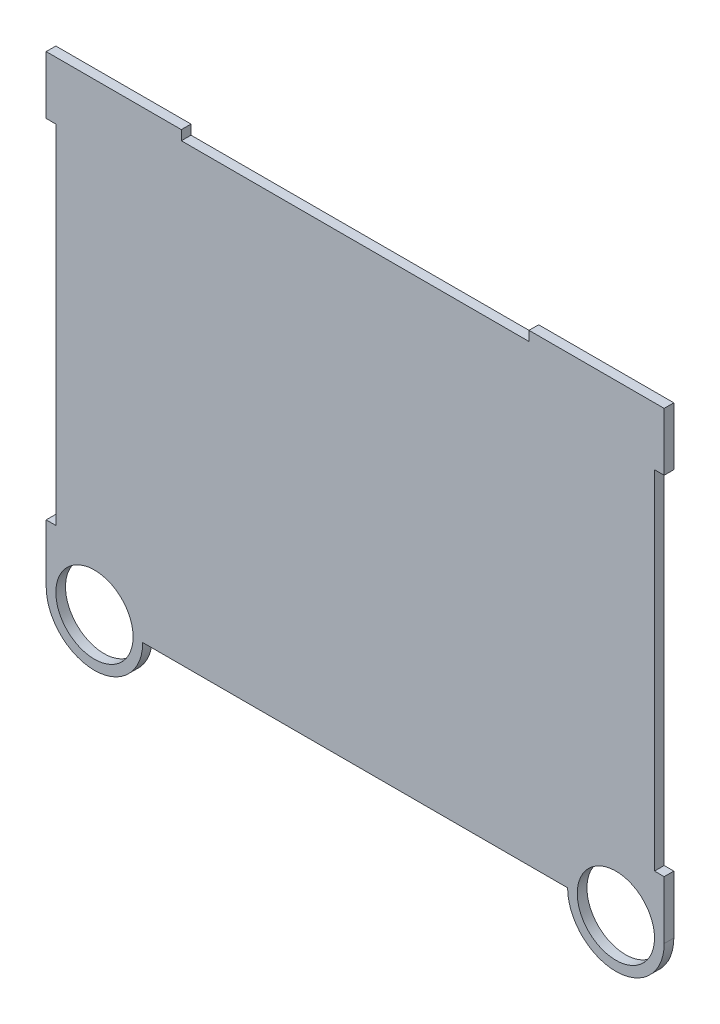
ISO-10303-21;
HEADER;
FILE_DESCRIPTION(('STEP AP214'),'2;1');
FILE_NAME('part.step','',(''),(''),'','','');
FILE_SCHEMA(('AUTOMOTIVE_DESIGN { 1 0 10303 214 1 1 1 1 }'));
ENDSEC;
DATA;
#1=APPLICATION_CONTEXT('core data for automotive mechanical design processes');
#2=APPLICATION_PROTOCOL_DEFINITION('international standard','automotive_design',2000,#1);
#3=PRODUCT_CONTEXT('',#1,'mechanical');
#4=PRODUCT('Part','Part','',(#3));
#5=PRODUCT_RELATED_PRODUCT_CATEGORY('part','',(#4));
#6=PRODUCT_DEFINITION_FORMATION('','',#4);
#7=PRODUCT_DEFINITION_CONTEXT('part definition',#1,'design');
#8=PRODUCT_DEFINITION('design','',#6,#7);
#9=PRODUCT_DEFINITION_SHAPE('','',#8);
#10=(LENGTH_UNIT() NAMED_UNIT(*) SI_UNIT(.MILLI.,.METRE.));
#11=(NAMED_UNIT(*) PLANE_ANGLE_UNIT() SI_UNIT($,.RADIAN.));
#12=(NAMED_UNIT(*) SI_UNIT($,.STERADIAN.) SOLID_ANGLE_UNIT());
#13=UNCERTAINTY_MEASURE_WITH_UNIT(LENGTH_MEASURE(1.E-05),#10,'distance_accuracy_value','');
#14=(GEOMETRIC_REPRESENTATION_CONTEXT(3) GLOBAL_UNCERTAINTY_ASSIGNED_CONTEXT((#13)) GLOBAL_UNIT_ASSIGNED_CONTEXT((#10,
#11,#12)) REPRESENTATION_CONTEXT('',''));
#15=CARTESIAN_POINT('',(0.,0.,0.));
#16=DIRECTION('',(0.,0.,1.));
#17=DIRECTION('',(1.,0.,0.));
#18=AXIS2_PLACEMENT_3D('',#15,#16,#17);
#19=CARTESIAN_POINT('',(203.2,0.,3.175));
#20=DIRECTION('',(-1.,0.,0.));
#21=DIRECTION('',(0.,0.,1.));
#22=AXIS2_PLACEMENT_3D('',#19,#20,#21);
#23=PLANE('',#22);
#24=DIRECTION('',(0.,1.,0.));
#25=VECTOR('',#24,1.);
#26=CARTESIAN_POINT('',(203.2,0.,0.));
#27=LINE('',#26,#25);
#28=CARTESIAN_POINT('',(203.2,0.,0.));
#29=VERTEX_POINT('',#28);
#30=CARTESIAN_POINT('',(203.2,19.05,0.));
#31=VERTEX_POINT('',#30);
#32=EDGE_CURVE('E184',#29,#31,#27,.T.);
#33=ORIENTED_EDGE('',*,*,#32,.T.);
#34=DIRECTION('',(0.,0.,1.));
#35=VECTOR('',#34,1.);
#36=CARTESIAN_POINT('',(203.2,19.05,0.));
#37=LINE('',#36,#35);
#38=CARTESIAN_POINT('',(203.2,19.05,3.175));
#39=VERTEX_POINT('',#38);
#40=EDGE_CURVE('E226',#31,#39,#37,.T.);
#41=ORIENTED_EDGE('',*,*,#40,.T.);
#42=DIRECTION('',(0.,1.,0.));
#43=VECTOR('',#42,1.);
#44=CARTESIAN_POINT('',(203.2,0.,3.175));
#45=LINE('',#44,#43);
#46=CARTESIAN_POINT('',(203.2,0.,3.175));
#47=VERTEX_POINT('',#46);
#48=EDGE_CURVE('E228',#47,#39,#45,.T.);
#49=ORIENTED_EDGE('',*,*,#48,.F.);
#50=DIRECTION('',(0.,0.,-1.));
#51=VECTOR('',#50,1.);
#52=CARTESIAN_POINT('',(203.2,0.,3.175));
#53=LINE('',#52,#51);
#54=EDGE_CURVE('E208',#47,#29,#53,.T.);
#55=ORIENTED_EDGE('',*,*,#54,.T.);
#56=EDGE_LOOP('',(#33,#41,#49,#55));
#57=FACE_BOUND('',#56,.T.);
#58=ADVANCED_FACE('F35',(#57),#23,.F.);
#59=CARTESIAN_POINT('',(0.,152.4,3.175));
#60=DIRECTION('',(0.,-1.,0.));
#61=DIRECTION('',(0.,0.,-1.));
#62=AXIS2_PLACEMENT_3D('',#59,#60,#61);
#63=PLANE('',#62);
#64=DIRECTION('',(-1.,0.,0.));
#65=VECTOR('',#64,1.);
#66=CARTESIAN_POINT('',(0.,152.4,0.));
#67=LINE('',#66,#65);
#68=CARTESIAN_POINT('',(203.2,152.4,0.));
#69=VERTEX_POINT('',#68);
#70=CARTESIAN_POINT('',(158.75,152.4,0.));
#71=VERTEX_POINT('',#70);
#72=EDGE_CURVE('E183',#69,#71,#67,.T.);
#73=ORIENTED_EDGE('',*,*,#72,.T.);
#74=DIRECTION('',(0.,0.,1.));
#75=VECTOR('',#74,1.);
#76=CARTESIAN_POINT('',(158.75,152.4,0.));
#77=LINE('',#76,#75);
#78=CARTESIAN_POINT('',(158.75,152.4,3.175));
#79=VERTEX_POINT('',#78);
#80=EDGE_CURVE('E281',#71,#79,#77,.T.);
#81=ORIENTED_EDGE('',*,*,#80,.T.);
#82=DIRECTION('',(-1.,0.,0.));
#83=VECTOR('',#82,1.);
#84=CARTESIAN_POINT('',(0.,152.4,3.175));
#85=LINE('',#84,#83);
#86=CARTESIAN_POINT('',(203.2,152.4,3.175));
#87=VERTEX_POINT('',#86);
#88=EDGE_CURVE('E233',#87,#79,#85,.T.);
#89=ORIENTED_EDGE('',*,*,#88,.F.);
#90=DIRECTION('',(0.,0.,-1.));
#91=VECTOR('',#90,1.);
#92=CARTESIAN_POINT('',(203.2,152.4,3.175));
#93=LINE('',#92,#91);
#94=EDGE_CURVE('E206',#87,#69,#93,.T.);
#95=ORIENTED_EDGE('',*,*,#94,.T.);
#96=EDGE_LOOP('',(#73,#81,#89,#95));
#97=FACE_BOUND('',#96,.T.);
#98=ADVANCED_FACE('F332',(#97),#63,.F.);
#99=CARTESIAN_POINT('',(0.,0.,3.175));
#100=DIRECTION('',(1.,0.,0.));
#101=DIRECTION('',(0.,0.,-1.));
#102=AXIS2_PLACEMENT_3D('',#99,#100,#101);
#103=PLANE('',#102);
#104=DIRECTION('',(0.,-1.,0.));
#105=VECTOR('',#104,1.);
#106=CARTESIAN_POINT('',(0.,0.,0.));
#107=LINE('',#106,#105);
#108=CARTESIAN_POINT('',(0.,152.4,0.));
#109=VERTEX_POINT('',#108);
#110=CARTESIAN_POINT('',(0.,133.35,0.));
#111=VERTEX_POINT('',#110);
#112=EDGE_CURVE('E195',#109,#111,#107,.T.);
#113=ORIENTED_EDGE('',*,*,#112,.T.);
#114=DIRECTION('',(0.,0.,1.));
#115=VECTOR('',#114,1.);
#116=CARTESIAN_POINT('',(0.,133.35,0.));
#117=LINE('',#116,#115);
#118=CARTESIAN_POINT('',(0.,133.35,3.175));
#119=VERTEX_POINT('',#118);
#120=EDGE_CURVE('E521',#111,#119,#117,.T.);
#121=ORIENTED_EDGE('',*,*,#120,.T.);
#122=DIRECTION('',(0.,-1.,0.));
#123=VECTOR('',#122,1.);
#124=CARTESIAN_POINT('',(0.,0.,3.175));
#125=LINE('',#124,#123);
#126=CARTESIAN_POINT('',(0.,152.4,3.175));
#127=VERTEX_POINT('',#126);
#128=EDGE_CURVE('E203',#127,#119,#125,.T.);
#129=ORIENTED_EDGE('',*,*,#128,.F.);
#130=DIRECTION('',(0.,0.,-1.));
#131=VECTOR('',#130,1.);
#132=CARTESIAN_POINT('',(0.,152.4,3.175));
#133=LINE('',#132,#131);
#134=EDGE_CURVE('E202',#127,#109,#133,.T.);
#135=ORIENTED_EDGE('',*,*,#134,.T.);
#136=EDGE_LOOP('',(#113,#121,#129,#135));
#137=FACE_BOUND('',#136,.T.);
#138=ADVANCED_FACE('F337',(#137),#103,.F.);
#139=CARTESIAN_POINT('',(15.875,0.,3.175));
#140=DIRECTION('',(0.,0.,-1.));
#141=DIRECTION('',(-1.,0.,0.));
#142=AXIS2_PLACEMENT_3D('',#139,#140,#141);
#143=CYLINDRICAL_SURFACE('',#142,15.875);
#144=CARTESIAN_POINT('',(15.875,0.,0.));
#145=DIRECTION('',(0.,0.,1.));
#146=DIRECTION('',(1.,0.,0.));
#147=AXIS2_PLACEMENT_3D('',#144,#145,#146);
#148=CIRCLE('',#147,15.875);
#149=CARTESIAN_POINT('',(0.,0.,0.));
#150=VERTEX_POINT('',#149);
#151=CARTESIAN_POINT('',(31.75,0.,0.));
#152=VERTEX_POINT('',#151);
#153=EDGE_CURVE('E242',#150,#152,#148,.T.);
#154=ORIENTED_EDGE('',*,*,#153,.T.);
#155=DIRECTION('',(0.,0.,-1.));
#156=VECTOR('',#155,1.);
#157=CARTESIAN_POINT('',(31.75,0.,3.175));
#158=LINE('',#157,#156);
#159=CARTESIAN_POINT('',(31.75,0.,3.175));
#160=VERTEX_POINT('',#159);
#161=EDGE_CURVE('E11',#160,#152,#158,.T.);
#162=ORIENTED_EDGE('',*,*,#161,.F.);
#163=CARTESIAN_POINT('',(15.875,0.,3.175));
#164=DIRECTION('',(0.,0.,1.));
#165=DIRECTION('',(1.,0.,0.));
#166=AXIS2_PLACEMENT_3D('',#163,#164,#165);
#167=CIRCLE('',#166,15.875);
#168=CARTESIAN_POINT('',(0.,0.,3.175));
#169=VERTEX_POINT('',#168);
#170=EDGE_CURVE('E198',#169,#160,#167,.T.);
#171=ORIENTED_EDGE('',*,*,#170,.F.);
#172=DIRECTION('',(0.,0.,-1.));
#173=VECTOR('',#172,1.);
#174=CARTESIAN_POINT('',(0.,0.,3.175));
#175=LINE('',#174,#173);
#176=EDGE_CURVE('E199',#169,#150,#175,.T.);
#177=ORIENTED_EDGE('',*,*,#176,.T.);
#178=EDGE_LOOP('',(#154,#162,#171,#177));
#179=FACE_BOUND('',#178,.T.);
#180=ADVANCED_FACE('F37',(#179),#143,.T.);
#181=CARTESIAN_POINT('',(31.75,0.,3.175));
#182=DIRECTION('',(0.,1.,0.));
#183=DIRECTION('',(0.,0.,1.));
#184=AXIS2_PLACEMENT_3D('',#181,#182,#183);
#185=PLANE('',#184);
#186=DIRECTION('',(1.,0.,0.));
#187=VECTOR('',#186,1.);
#188=CARTESIAN_POINT('',(31.75,0.,0.));
#189=LINE('',#188,#187);
#190=CARTESIAN_POINT('',(171.45,0.,0.));
#191=VERTEX_POINT('',#190);
#192=EDGE_CURVE('E189',#152,#191,#189,.T.);
#193=ORIENTED_EDGE('',*,*,#192,.T.);
#194=DIRECTION('',(0.,0.,-1.));
#195=VECTOR('',#194,1.);
#196=CARTESIAN_POINT('',(171.45,0.,3.175));
#197=LINE('',#196,#195);
#198=CARTESIAN_POINT('',(171.45,0.,3.175));
#199=VERTEX_POINT('',#198);
#200=EDGE_CURVE('E43',#199,#191,#197,.T.);
#201=ORIENTED_EDGE('',*,*,#200,.F.);
#202=DIRECTION('',(1.,0.,0.));
#203=VECTOR('',#202,1.);
#204=CARTESIAN_POINT('',(31.75,0.,3.175));
#205=LINE('',#204,#203);
#206=EDGE_CURVE('E247',#160,#199,#205,.T.);
#207=ORIENTED_EDGE('',*,*,#206,.F.);
#208=ORIENTED_EDGE('',*,*,#161,.T.);
#209=EDGE_LOOP('',(#193,#201,#207,#208));
#210=FACE_BOUND('',#209,.T.);
#211=ADVANCED_FACE('F245',(#210),#185,.F.);
#212=CARTESIAN_POINT('',(187.325,0.,3.175));
#213=DIRECTION('',(0.,0.,-1.));
#214=DIRECTION('',(-1.,0.,0.));
#215=AXIS2_PLACEMENT_3D('',#212,#213,#214);
#216=CYLINDRICAL_SURFACE('',#215,15.875);
#217=CARTESIAN_POINT('',(187.325,0.,0.));
#218=DIRECTION('',(0.,0.,1.));
#219=DIRECTION('',(1.,0.,0.));
#220=AXIS2_PLACEMENT_3D('',#217,#218,#219);
#221=CIRCLE('',#220,15.875);
#222=EDGE_CURVE('E185',#191,#29,#221,.T.);
#223=ORIENTED_EDGE('',*,*,#222,.T.);
#224=ORIENTED_EDGE('',*,*,#54,.F.);
#225=CARTESIAN_POINT('',(187.325,0.,3.175));
#226=DIRECTION('',(0.,0.,1.));
#227=DIRECTION('',(1.,0.,0.));
#228=AXIS2_PLACEMENT_3D('',#225,#226,#227);
#229=CIRCLE('',#228,15.875);
#230=EDGE_CURVE('E217',#199,#47,#229,.T.);
#231=ORIENTED_EDGE('',*,*,#230,.F.);
#232=ORIENTED_EDGE('',*,*,#200,.T.);
#233=EDGE_LOOP('',(#223,#224,#231,#232));
#234=FACE_BOUND('',#233,.T.);
#235=ADVANCED_FACE('F215',(#234),#216,.T.);
#236=CARTESIAN_POINT('',(203.2,133.35,3.175));
#237=VERTEX_POINT('',#236);
#238=EDGE_CURVE('E176',#237,#87,#45,.T.);
#239=ORIENTED_EDGE('',*,*,#238,.F.);
#240=DIRECTION('',(0.,0.,1.));
#241=VECTOR('',#240,1.);
#242=CARTESIAN_POINT('',(203.2,133.35,0.));
#243=LINE('',#242,#241);
#244=CARTESIAN_POINT('',(203.2,133.35,0.));
#245=VERTEX_POINT('',#244);
#246=EDGE_CURVE('E163',#245,#237,#243,.T.);
#247=ORIENTED_EDGE('',*,*,#246,.F.);
#248=EDGE_CURVE('E174',#245,#69,#27,.T.);
#249=ORIENTED_EDGE('',*,*,#248,.T.);
#250=ORIENTED_EDGE('',*,*,#94,.F.);
#251=EDGE_LOOP('',(#239,#247,#249,#250));
#252=FACE_BOUND('',#251,.T.);
#253=ADVANCED_FACE('F172',(#252),#23,.F.);
#254=CARTESIAN_POINT('',(44.45,152.4,3.175));
#255=VERTEX_POINT('',#254);
#256=EDGE_CURVE('E231',#255,#127,#85,.T.);
#257=ORIENTED_EDGE('',*,*,#256,.F.);
#258=DIRECTION('',(0.,0.,1.));
#259=VECTOR('',#258,1.);
#260=CARTESIAN_POINT('',(44.45,152.4,0.));
#261=LINE('',#260,#259);
#262=CARTESIAN_POINT('',(44.45,152.4,0.));
#263=VERTEX_POINT('',#262);
#264=EDGE_CURVE('E294',#263,#255,#261,.T.);
#265=ORIENTED_EDGE('',*,*,#264,.F.);
#266=EDGE_CURVE('E188',#263,#109,#67,.T.);
#267=ORIENTED_EDGE('',*,*,#266,.T.);
#268=ORIENTED_EDGE('',*,*,#134,.F.);
#269=EDGE_LOOP('',(#257,#265,#267,#268));
#270=FACE_BOUND('',#269,.T.);
#271=ADVANCED_FACE('F340',(#270),#63,.F.);
#272=CARTESIAN_POINT('',(0.,19.05,3.175));
#273=VERTEX_POINT('',#272);
#274=EDGE_CURVE('E239',#273,#169,#125,.T.);
#275=ORIENTED_EDGE('',*,*,#274,.F.);
#276=DIRECTION('',(0.,0.,1.));
#277=VECTOR('',#276,1.);
#278=CARTESIAN_POINT('',(0.,19.05,0.));
#279=LINE('',#278,#277);
#280=CARTESIAN_POINT('',(0.,19.05,0.));
#281=VERTEX_POINT('',#280);
#282=EDGE_CURVE('E259',#281,#273,#279,.T.);
#283=ORIENTED_EDGE('',*,*,#282,.F.);
#284=EDGE_CURVE('E194',#281,#150,#107,.T.);
#285=ORIENTED_EDGE('',*,*,#284,.T.);
#286=ORIENTED_EDGE('',*,*,#176,.F.);
#287=EDGE_LOOP('',(#275,#283,#285,#286));
#288=FACE_BOUND('',#287,.T.);
#289=ADVANCED_FACE('F258',(#288),#103,.F.);
#290=CARTESIAN_POINT('',(15.875,0.,3.175));
#291=DIRECTION('',(0.,0.,1.));
#292=DIRECTION('',(1.,0.,0.));
#293=AXIS2_PLACEMENT_3D('',#290,#291,#292);
#294=PLANE('',#293);
#295=DIRECTION('',(1.,0.,0.));
#296=VECTOR('',#295,1.);
#297=CARTESIAN_POINT('',(203.2,19.05,3.175));
#298=LINE('',#297,#296);
#299=CARTESIAN_POINT('',(200.025,19.05,3.175));
#300=VERTEX_POINT('',#299);
#301=EDGE_CURVE('E168',#300,#39,#298,.T.);
#302=ORIENTED_EDGE('',*,*,#301,.F.);
#303=DIRECTION('',(0.,-1.,0.));
#304=VECTOR('',#303,1.);
#305=CARTESIAN_POINT('',(200.025,19.05,3.175));
#306=LINE('',#305,#304);
#307=CARTESIAN_POINT('',(200.025,133.35,3.175));
#308=VERTEX_POINT('',#307);
#309=EDGE_CURVE('E516',#308,#300,#306,.T.);
#310=ORIENTED_EDGE('',*,*,#309,.F.);
#311=DIRECTION('',(-1.,0.,0.));
#312=VECTOR('',#311,1.);
#313=CARTESIAN_POINT('',(203.2,133.35,3.175));
#314=LINE('',#313,#312);
#315=EDGE_CURVE('E518',#237,#308,#314,.T.);
#316=ORIENTED_EDGE('',*,*,#315,.F.);
#317=ORIENTED_EDGE('',*,*,#238,.T.);
#318=ORIENTED_EDGE('',*,*,#88,.T.);
#319=DIRECTION('',(0.,1.,0.));
#320=VECTOR('',#319,1.);
#321=CARTESIAN_POINT('',(158.75,152.4,3.175));
#322=LINE('',#321,#320);
#323=CARTESIAN_POINT('',(158.75,149.225,3.175));
#324=VERTEX_POINT('',#323);
#325=EDGE_CURVE('E282',#324,#79,#322,.T.);
#326=ORIENTED_EDGE('',*,*,#325,.F.);
#327=DIRECTION('',(1.,0.,0.));
#328=VECTOR('',#327,1.);
#329=CARTESIAN_POINT('',(158.75,149.225,3.175));
#330=LINE('',#329,#328);
#331=CARTESIAN_POINT('',(44.45,149.225,3.175));
#332=VERTEX_POINT('',#331);
#333=EDGE_CURVE('E275',#332,#324,#330,.T.);
#334=ORIENTED_EDGE('',*,*,#333,.F.);
#335=DIRECTION('',(0.,-1.,0.));
#336=VECTOR('',#335,1.);
#337=CARTESIAN_POINT('',(44.45,152.4,3.175));
#338=LINE('',#337,#336);
#339=EDGE_CURVE('E284',#255,#332,#338,.T.);
#340=ORIENTED_EDGE('',*,*,#339,.F.);
#341=ORIENTED_EDGE('',*,*,#256,.T.);
#342=ORIENTED_EDGE('',*,*,#128,.T.);
#343=DIRECTION('',(-1.,0.,0.));
#344=VECTOR('',#343,1.);
#345=CARTESIAN_POINT('',(0.,133.35,3.175));
#346=LINE('',#345,#344);
#347=CARTESIAN_POINT('',(3.17500000000001,133.35,3.175));
#348=VERTEX_POINT('',#347);
#349=EDGE_CURVE('E529',#348,#119,#346,.T.);
#350=ORIENTED_EDGE('',*,*,#349,.F.);
#351=DIRECTION('',(0.,1.,0.));
#352=VECTOR('',#351,1.);
#353=CARTESIAN_POINT('',(3.17500000000001,19.05,3.175));
#354=LINE('',#353,#352);
#355=CARTESIAN_POINT('',(3.17500000000001,19.05,3.175));
#356=VERTEX_POINT('',#355);
#357=EDGE_CURVE('E532',#356,#348,#354,.T.);
#358=ORIENTED_EDGE('',*,*,#357,.F.);
#359=DIRECTION('',(1.,0.,0.));
#360=VECTOR('',#359,1.);
#361=CARTESIAN_POINT('',(0.,19.05,3.175));
#362=LINE('',#361,#360);
#363=EDGE_CURVE('E291',#273,#356,#362,.T.);
#364=ORIENTED_EDGE('',*,*,#363,.F.);
#365=ORIENTED_EDGE('',*,*,#274,.T.);
#366=ORIENTED_EDGE('',*,*,#170,.T.);
#367=ORIENTED_EDGE('',*,*,#206,.T.);
#368=ORIENTED_EDGE('',*,*,#230,.T.);
#369=ORIENTED_EDGE('',*,*,#48,.T.);
#370=EDGE_LOOP('',(#302,#310,#316,#317,#318,#326,#334,#340,#341,#342,#350,#358,#364,#365,#366,
#367,#368,#369));
#371=FACE_BOUND('',#370,.T.);
#372=CARTESIAN_POINT('',(15.875,0.,3.175));
#373=DIRECTION('',(0.,0.,1.));
#374=DIRECTION('',(1.,0.,0.));
#375=AXIS2_PLACEMENT_3D('',#372,#373,#374);
#376=CIRCLE('',#375,12.7);
#377=CARTESIAN_POINT('',(28.575,0.,3.175));
#378=VERTEX_POINT('',#377);
#379=EDGE_CURVE('E244',#378,#378,#376,.T.);
#380=ORIENTED_EDGE('',*,*,#379,.F.);
#381=EDGE_LOOP('',(#380));
#382=FACE_BOUND('',#381,.T.);
#383=CARTESIAN_POINT('',(187.325,0.,3.175));
#384=DIRECTION('',(0.,0.,1.));
#385=DIRECTION('',(1.,0.,0.));
#386=AXIS2_PLACEMENT_3D('',#383,#384,#385);
#387=CIRCLE('',#386,12.7);
#388=CARTESIAN_POINT('',(200.025,0.,3.175));
#389=VERTEX_POINT('',#388);
#390=EDGE_CURVE('E301',#389,#389,#387,.T.);
#391=ORIENTED_EDGE('',*,*,#390,.F.);
#392=EDGE_LOOP('',(#391));
#393=FACE_BOUND('',#392,.T.);
#394=ADVANCED_FACE('F309',(#371,#382,#393),#294,.T.);
#395=CARTESIAN_POINT('',(15.875,0.,0.));
#396=DIRECTION('',(0.,0.,1.));
#397=DIRECTION('',(1.,0.,0.));
#398=AXIS2_PLACEMENT_3D('',#395,#396,#397);
#399=PLANE('',#398);
#400=CARTESIAN_POINT('',(15.875,0.,0.));
#401=DIRECTION('',(0.,0.,1.));
#402=DIRECTION('',(1.,0.,0.));
#403=AXIS2_PLACEMENT_3D('',#400,#401,#402);
#404=CIRCLE('',#403,12.7);
#405=CARTESIAN_POINT('',(28.575,0.,0.));
#406=VERTEX_POINT('',#405);
#407=EDGE_CURVE('E298',#406,#406,#404,.T.);
#408=ORIENTED_EDGE('',*,*,#407,.T.);
#409=EDGE_LOOP('',(#408));
#410=FACE_BOUND('',#409,.T.);
#411=CARTESIAN_POINT('',(187.325,0.,0.));
#412=DIRECTION('',(0.,0.,1.));
#413=DIRECTION('',(1.,0.,0.));
#414=AXIS2_PLACEMENT_3D('',#411,#412,#413);
#415=CIRCLE('',#414,12.7);
#416=CARTESIAN_POINT('',(200.025,0.,0.));
#417=VERTEX_POINT('',#416);
#418=EDGE_CURVE('E302',#417,#417,#415,.T.);
#419=ORIENTED_EDGE('',*,*,#418,.T.);
#420=EDGE_LOOP('',(#419));
#421=FACE_BOUND('',#420,.T.);
#422=DIRECTION('',(0.,-1.,0.));
#423=VECTOR('',#422,1.);
#424=CARTESIAN_POINT('',(200.025,19.05,0.));
#425=LINE('',#424,#423);
#426=CARTESIAN_POINT('',(200.025,133.35,0.));
#427=VERTEX_POINT('',#426);
#428=CARTESIAN_POINT('',(200.025,19.05,0.));
#429=VERTEX_POINT('',#428);
#430=EDGE_CURVE('E50',#427,#429,#425,.T.);
#431=ORIENTED_EDGE('',*,*,#430,.T.);
#432=DIRECTION('',(1.,0.,0.));
#433=VECTOR('',#432,1.);
#434=CARTESIAN_POINT('',(203.2,19.05,0.));
#435=LINE('',#434,#433);
#436=EDGE_CURVE('E177',#429,#31,#435,.T.);
#437=ORIENTED_EDGE('',*,*,#436,.T.);
#438=ORIENTED_EDGE('',*,*,#32,.F.);
#439=ORIENTED_EDGE('',*,*,#222,.F.);
#440=ORIENTED_EDGE('',*,*,#192,.F.);
#441=ORIENTED_EDGE('',*,*,#153,.F.);
#442=ORIENTED_EDGE('',*,*,#284,.F.);
#443=DIRECTION('',(1.,0.,0.));
#444=VECTOR('',#443,1.);
#445=CARTESIAN_POINT('',(0.,19.05,0.));
#446=LINE('',#445,#444);
#447=CARTESIAN_POINT('',(3.17500000000001,19.05,0.));
#448=VERTEX_POINT('',#447);
#449=EDGE_CURVE('E254',#281,#448,#446,.T.);
#450=ORIENTED_EDGE('',*,*,#449,.T.);
#451=DIRECTION('',(0.,1.,0.));
#452=VECTOR('',#451,1.);
#453=CARTESIAN_POINT('',(3.17500000000001,19.05,0.));
#454=LINE('',#453,#452);
#455=CARTESIAN_POINT('',(3.17500000000001,133.35,0.));
#456=VERTEX_POINT('',#455);
#457=EDGE_CURVE('E58',#448,#456,#454,.T.);
#458=ORIENTED_EDGE('',*,*,#457,.T.);
#459=DIRECTION('',(-1.,0.,0.));
#460=VECTOR('',#459,1.);
#461=CARTESIAN_POINT('',(0.,133.35,0.));
#462=LINE('',#461,#460);
#463=EDGE_CURVE('E264',#456,#111,#462,.T.);
#464=ORIENTED_EDGE('',*,*,#463,.T.);
#465=ORIENTED_EDGE('',*,*,#112,.F.);
#466=ORIENTED_EDGE('',*,*,#266,.F.);
#467=DIRECTION('',(0.,-1.,0.));
#468=VECTOR('',#467,1.);
#469=CARTESIAN_POINT('',(44.45,152.4,0.));
#470=LINE('',#469,#468);
#471=CARTESIAN_POINT('',(44.45,149.225,0.));
#472=VERTEX_POINT('',#471);
#473=EDGE_CURVE('E274',#263,#472,#470,.T.);
#474=ORIENTED_EDGE('',*,*,#473,.T.);
#475=DIRECTION('',(1.,0.,0.));
#476=VECTOR('',#475,1.);
#477=CARTESIAN_POINT('',(158.75,149.225,0.));
#478=LINE('',#477,#476);
#479=CARTESIAN_POINT('',(158.75,149.225,0.));
#480=VERTEX_POINT('',#479);
#481=EDGE_CURVE('E278',#472,#480,#478,.T.);
#482=ORIENTED_EDGE('',*,*,#481,.T.);
#483=DIRECTION('',(0.,1.,0.));
#484=VECTOR('',#483,1.);
#485=CARTESIAN_POINT('',(158.75,152.4,0.));
#486=LINE('',#485,#484);
#487=EDGE_CURVE('E272',#480,#71,#486,.T.);
#488=ORIENTED_EDGE('',*,*,#487,.T.);
#489=ORIENTED_EDGE('',*,*,#72,.F.);
#490=ORIENTED_EDGE('',*,*,#248,.F.);
#491=DIRECTION('',(-1.,0.,0.));
#492=VECTOR('',#491,1.);
#493=CARTESIAN_POINT('',(203.2,133.35,0.));
#494=LINE('',#493,#492);
#495=EDGE_CURVE('E159',#245,#427,#494,.T.);
#496=ORIENTED_EDGE('',*,*,#495,.T.);
#497=EDGE_LOOP('',(#431,#437,#438,#439,#440,#441,#442,#450,#458,#464,#465,#466,#474,#482,#488,
#489,#490,#496));
#498=FACE_BOUND('',#497,.T.);
#499=ADVANCED_FACE('F180',(#410,#421,#498),#399,.F.);
#500=CARTESIAN_POINT('',(187.325,0.,0.));
#501=DIRECTION('',(0.,0.,1.));
#502=DIRECTION('',(1.,0.,0.));
#503=AXIS2_PLACEMENT_3D('',#500,#501,#502);
#504=CYLINDRICAL_SURFACE('',#503,12.7);
#505=ORIENTED_EDGE('',*,*,#390,.T.);
#506=EDGE_LOOP('',(#505));
#507=FACE_BOUND('',#506,.T.);
#508=ORIENTED_EDGE('',*,*,#418,.F.);
#509=EDGE_LOOP('',(#508));
#510=FACE_BOUND('',#509,.T.);
#511=ADVANCED_FACE('F318',(#507,#510),#504,.F.);
#512=CARTESIAN_POINT('',(15.875,0.,0.));
#513=DIRECTION('',(0.,0.,1.));
#514=DIRECTION('',(1.,0.,0.));
#515=AXIS2_PLACEMENT_3D('',#512,#513,#514);
#516=CYLINDRICAL_SURFACE('',#515,12.7);
#517=ORIENTED_EDGE('',*,*,#379,.T.);
#518=EDGE_LOOP('',(#517));
#519=FACE_BOUND('',#518,.T.);
#520=ORIENTED_EDGE('',*,*,#407,.F.);
#521=EDGE_LOOP('',(#520));
#522=FACE_BOUND('',#521,.T.);
#523=ADVANCED_FACE('F321',(#519,#522),#516,.F.);
#524=CARTESIAN_POINT('',(158.75,152.4,0.));
#525=DIRECTION('',(1.,0.,0.));
#526=DIRECTION('',(0.,0.,-1.));
#527=AXIS2_PLACEMENT_3D('',#524,#525,#526);
#528=PLANE('',#527);
#529=ORIENTED_EDGE('',*,*,#325,.T.);
#530=ORIENTED_EDGE('',*,*,#80,.F.);
#531=ORIENTED_EDGE('',*,*,#487,.F.);
#532=DIRECTION('',(0.,0.,1.));
#533=VECTOR('',#532,1.);
#534=CARTESIAN_POINT('',(158.75,149.225,0.));
#535=LINE('',#534,#533);
#536=EDGE_CURVE('E289',#480,#324,#535,.T.);
#537=ORIENTED_EDGE('',*,*,#536,.T.);
#538=EDGE_LOOP('',(#529,#530,#531,#537));
#539=FACE_BOUND('',#538,.T.);
#540=ADVANCED_FACE('F379',(#539),#528,.F.);
#541=CARTESIAN_POINT('',(158.75,149.225,0.));
#542=DIRECTION('',(0.,-1.,0.));
#543=DIRECTION('',(1.,0.,0.));
#544=AXIS2_PLACEMENT_3D('',#541,#542,#543);
#545=PLANE('',#544);
#546=ORIENTED_EDGE('',*,*,#333,.T.);
#547=ORIENTED_EDGE('',*,*,#536,.F.);
#548=ORIENTED_EDGE('',*,*,#481,.F.);
#549=DIRECTION('',(0.,0.,1.));
#550=VECTOR('',#549,1.);
#551=CARTESIAN_POINT('',(44.45,149.225,0.));
#552=LINE('',#551,#550);
#553=EDGE_CURVE('E292',#472,#332,#552,.T.);
#554=ORIENTED_EDGE('',*,*,#553,.T.);
#555=EDGE_LOOP('',(#546,#547,#548,#554));
#556=FACE_BOUND('',#555,.T.);
#557=ADVANCED_FACE('F384',(#556),#545,.F.);
#558=CARTESIAN_POINT('',(44.45,152.4,0.));
#559=DIRECTION('',(-1.,0.,0.));
#560=DIRECTION('',(0.,0.,1.));
#561=AXIS2_PLACEMENT_3D('',#558,#559,#560);
#562=PLANE('',#561);
#563=ORIENTED_EDGE('',*,*,#339,.T.);
#564=ORIENTED_EDGE('',*,*,#553,.F.);
#565=ORIENTED_EDGE('',*,*,#473,.F.);
#566=ORIENTED_EDGE('',*,*,#264,.T.);
#567=EDGE_LOOP('',(#563,#564,#565,#566));
#568=FACE_BOUND('',#567,.T.);
#569=ADVANCED_FACE('F396',(#568),#562,.F.);
#570=CARTESIAN_POINT('',(0.,133.35,0.));
#571=DIRECTION('',(0.,1.,0.));
#572=DIRECTION('',(0.,0.,1.));
#573=AXIS2_PLACEMENT_3D('',#570,#571,#572);
#574=PLANE('',#573);
#575=ORIENTED_EDGE('',*,*,#349,.T.);
#576=ORIENTED_EDGE('',*,*,#120,.F.);
#577=ORIENTED_EDGE('',*,*,#463,.F.);
#578=DIRECTION('',(0.,0.,1.));
#579=VECTOR('',#578,1.);
#580=CARTESIAN_POINT('',(3.17500000000001,133.35,0.));
#581=LINE('',#580,#579);
#582=EDGE_CURVE('E266',#456,#348,#581,.T.);
#583=ORIENTED_EDGE('',*,*,#582,.T.);
#584=EDGE_LOOP('',(#575,#576,#577,#583));
#585=FACE_BOUND('',#584,.T.);
#586=ADVANCED_FACE('F406',(#585),#574,.F.);
#587=CARTESIAN_POINT('',(3.17500000000001,19.05,0.));
#588=DIRECTION('',(1.,0.,0.));
#589=DIRECTION('',(0.,0.,-1.));
#590=AXIS2_PLACEMENT_3D('',#587,#588,#589);
#591=PLANE('',#590);
#592=ORIENTED_EDGE('',*,*,#357,.T.);
#593=ORIENTED_EDGE('',*,*,#582,.F.);
#594=ORIENTED_EDGE('',*,*,#457,.F.);
#595=DIRECTION('',(0.,0.,1.));
#596=VECTOR('',#595,1.);
#597=CARTESIAN_POINT('',(3.17500000000001,19.05,0.));
#598=LINE('',#597,#596);
#599=EDGE_CURVE('E263',#448,#356,#598,.T.);
#600=ORIENTED_EDGE('',*,*,#599,.T.);
#601=EDGE_LOOP('',(#592,#593,#594,#600));
#602=FACE_BOUND('',#601,.T.);
#603=ADVANCED_FACE('F416',(#602),#591,.F.);
#604=CARTESIAN_POINT('',(0.,19.05,0.));
#605=DIRECTION('',(0.,-1.,0.));
#606=DIRECTION('',(1.,0.,0.));
#607=AXIS2_PLACEMENT_3D('',#604,#605,#606);
#608=PLANE('',#607);
#609=ORIENTED_EDGE('',*,*,#363,.T.);
#610=ORIENTED_EDGE('',*,*,#599,.F.);
#611=ORIENTED_EDGE('',*,*,#449,.F.);
#612=ORIENTED_EDGE('',*,*,#282,.T.);
#613=EDGE_LOOP('',(#609,#610,#611,#612));
#614=FACE_BOUND('',#613,.T.);
#615=ADVANCED_FACE('F426',(#614),#608,.F.);
#616=CARTESIAN_POINT('',(203.2,19.05,0.));
#617=DIRECTION('',(0.,-1.,0.));
#618=DIRECTION('',(0.,0.,-1.));
#619=AXIS2_PLACEMENT_3D('',#616,#617,#618);
#620=PLANE('',#619);
#621=ORIENTED_EDGE('',*,*,#301,.T.);
#622=ORIENTED_EDGE('',*,*,#40,.F.);
#623=ORIENTED_EDGE('',*,*,#436,.F.);
#624=DIRECTION('',(0.,0.,1.));
#625=VECTOR('',#624,1.);
#626=CARTESIAN_POINT('',(200.025,19.05,0.));
#627=LINE('',#626,#625);
#628=EDGE_CURVE('E517',#429,#300,#627,.T.);
#629=ORIENTED_EDGE('',*,*,#628,.T.);
#630=EDGE_LOOP('',(#621,#622,#623,#629));
#631=FACE_BOUND('',#630,.T.);
#632=ADVANCED_FACE('F435',(#631),#620,.F.);
#633=CARTESIAN_POINT('',(200.025,19.05,0.));
#634=DIRECTION('',(-1.,0.,0.));
#635=DIRECTION('',(0.,0.,1.));
#636=AXIS2_PLACEMENT_3D('',#633,#634,#635);
#637=PLANE('',#636);
#638=ORIENTED_EDGE('',*,*,#309,.T.);
#639=ORIENTED_EDGE('',*,*,#628,.F.);
#640=ORIENTED_EDGE('',*,*,#430,.F.);
#641=DIRECTION('',(0.,0.,1.));
#642=VECTOR('',#641,1.);
#643=CARTESIAN_POINT('',(200.025,133.35,0.));
#644=LINE('',#643,#642);
#645=EDGE_CURVE('E165',#427,#308,#644,.T.);
#646=ORIENTED_EDGE('',*,*,#645,.T.);
#647=EDGE_LOOP('',(#638,#639,#640,#646));
#648=FACE_BOUND('',#647,.T.);
#649=ADVANCED_FACE('F444',(#648),#637,.F.);
#650=CARTESIAN_POINT('',(203.2,133.35,0.));
#651=DIRECTION('',(0.,1.,0.));
#652=DIRECTION('',(0.,0.,1.));
#653=AXIS2_PLACEMENT_3D('',#650,#651,#652);
#654=PLANE('',#653);
#655=ORIENTED_EDGE('',*,*,#315,.T.);
#656=ORIENTED_EDGE('',*,*,#645,.F.);
#657=ORIENTED_EDGE('',*,*,#495,.F.);
#658=ORIENTED_EDGE('',*,*,#246,.T.);
#659=EDGE_LOOP('',(#655,#656,#657,#658));
#660=FACE_BOUND('',#659,.T.);
#661=ADVANCED_FACE('F162',(#660),#654,.F.);
#662=CLOSED_SHELL('',(#58,#98,#138,#180,#211,#235,#253,#271,#289,#394,#499,#511,#523,#540,#557,
#569,#586,#603,#615,#632,#649,#661));
#663=MANIFOLD_SOLID_BREP('B2',#662);
#664=ADVANCED_BREP_SHAPE_REPRESENTATION('',(#18,#663),#14);
#665=SHAPE_DEFINITION_REPRESENTATION(#9,#664);
ENDSEC;
END-ISO-10303-21;
